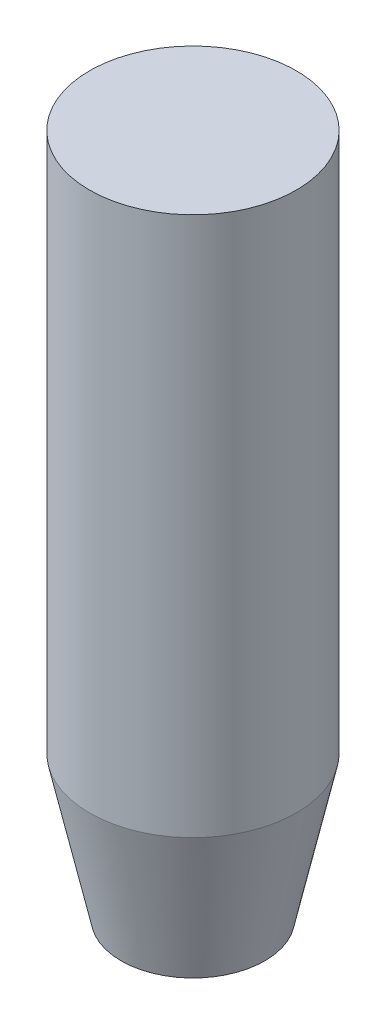
ISO-10303-21;
HEADER;
FILE_DESCRIPTION(('STEP AP214'),'2;1');
FILE_NAME('part.step','',(''),(''),'','','');
FILE_SCHEMA(('AUTOMOTIVE_DESIGN { 1 0 10303 214 1 1 1 1 }'));
ENDSEC;
DATA;
#1=APPLICATION_CONTEXT('core data for automotive mechanical design processes');
#2=APPLICATION_PROTOCOL_DEFINITION('international standard','automotive_design',2000,#1);
#3=PRODUCT_CONTEXT('',#1,'mechanical');
#4=PRODUCT('Part','Part','',(#3));
#5=PRODUCT_RELATED_PRODUCT_CATEGORY('part','',(#4));
#6=PRODUCT_DEFINITION_FORMATION('','',#4);
#7=PRODUCT_DEFINITION_CONTEXT('part definition',#1,'design');
#8=PRODUCT_DEFINITION('design','',#6,#7);
#9=PRODUCT_DEFINITION_SHAPE('','',#8);
#10=(LENGTH_UNIT() NAMED_UNIT(*) SI_UNIT(.MILLI.,.METRE.));
#11=(NAMED_UNIT(*) PLANE_ANGLE_UNIT() SI_UNIT($,.RADIAN.));
#12=(NAMED_UNIT(*) SI_UNIT($,.STERADIAN.) SOLID_ANGLE_UNIT());
#13=UNCERTAINTY_MEASURE_WITH_UNIT(LENGTH_MEASURE(1.E-05),#10,'distance_accuracy_value','');
#14=(GEOMETRIC_REPRESENTATION_CONTEXT(3) GLOBAL_UNCERTAINTY_ASSIGNED_CONTEXT((#13)) GLOBAL_UNIT_ASSIGNED_CONTEXT((#10,
#11,#12)) REPRESENTATION_CONTEXT('',''));
#15=CARTESIAN_POINT('',(0.,0.,0.));
#16=DIRECTION('',(0.,0.,1.));
#17=DIRECTION('',(1.,0.,0.));
#18=AXIS2_PLACEMENT_3D('',#15,#16,#17);
#19=CARTESIAN_POINT('',(0.,120.65,0.));
#20=DIRECTION('',(0.,-1.,0.));
#21=DIRECTION('',(0.,0.,-1.));
#22=AXIS2_PLACEMENT_3D('',#19,#20,#21);
#23=CYLINDRICAL_SURFACE('',#22,18.25625);
#24=CARTESIAN_POINT('',(0.,25.4000000000012,0.));
#25=DIRECTION('',(0.,1.,0.));
#26=DIRECTION('',(0.,0.,1.));
#27=AXIS2_PLACEMENT_3D('',#24,#25,#26);
#28=CIRCLE('',#27,18.25625);
#29=CARTESIAN_POINT('',(0.,25.4000000000012,18.25625));
#30=VERTEX_POINT('',#29);
#31=EDGE_CURVE('E38',#30,#30,#28,.T.);
#32=ORIENTED_EDGE('',*,*,#31,.T.);
#33=EDGE_LOOP('',(#32));
#34=FACE_BOUND('',#33,.T.);
#35=CARTESIAN_POINT('',(0.,120.65,0.));
#36=DIRECTION('',(0.,1.,0.));
#37=DIRECTION('',(0.,0.,1.));
#38=AXIS2_PLACEMENT_3D('',#35,#36,#37);
#39=CIRCLE('',#38,18.25625);
#40=CARTESIAN_POINT('',(0.,120.65,18.25625));
#41=VERTEX_POINT('',#40);
#42=EDGE_CURVE('E42',#41,#41,#39,.T.);
#43=ORIENTED_EDGE('',*,*,#42,.F.);
#44=EDGE_LOOP('',(#43));
#45=FACE_BOUND('',#44,.T.);
#46=ADVANCED_FACE('F31',(#34,#45),#23,.T.);
#47=CARTESIAN_POINT('',(0.,120.65,0.));
#48=DIRECTION('',(0.,1.,0.));
#49=DIRECTION('',(0.,0.,1.));
#50=AXIS2_PLACEMENT_3D('',#47,#48,#49);
#51=PLANE('',#50);
#52=ORIENTED_EDGE('',*,*,#42,.T.);
#53=EDGE_LOOP('',(#52));
#54=FACE_BOUND('',#53,.T.);
#55=ADVANCED_FACE('F49',(#54),#51,.T.);
#56=CARTESIAN_POINT('',(0.,0.,0.));
#57=DIRECTION('',(0.,1.,0.));
#58=DIRECTION('',(0.,0.,1.));
#59=AXIS2_PLACEMENT_3D('',#56,#57,#58);
#60=PLANE('',#59);
#61=CARTESIAN_POINT('',(0.,0.,0.));
#62=DIRECTION('',(0.,1.,0.));
#63=DIRECTION('',(0.,0.,1.));
#64=AXIS2_PLACEMENT_3D('',#61,#62,#63);
#65=CIRCLE('',#64,12.6999999999998);
#66=CARTESIAN_POINT('',(0.,0.,12.6999999999998));
#67=VERTEX_POINT('',#66);
#68=EDGE_CURVE('E10',#67,#67,#65,.F.);
#69=ORIENTED_EDGE('',*,*,#68,.T.);
#70=EDGE_LOOP('',(#69));
#71=FACE_BOUND('',#70,.T.);
#72=ADVANCED_FACE('F55',(#71),#60,.F.);
#73=CARTESIAN_POINT('',(0.,25.4000000000012,0.));
#74=DIRECTION('',(0.,1.,0.));
#75=DIRECTION('',(0.,0.,1.));
#76=AXIS2_PLACEMENT_3D('',#73,#74,#75);
#77=CONICAL_SURFACE('',#76,18.25625,0.215357699697737);
#78=ORIENTED_EDGE('',*,*,#68,.F.);
#79=EDGE_LOOP('',(#78));
#80=FACE_BOUND('',#79,.T.);
#81=ORIENTED_EDGE('',*,*,#31,.F.);
#82=EDGE_LOOP('',(#81));
#83=FACE_BOUND('',#82,.T.);
#84=ADVANCED_FACE('F33',(#80,#83),#77,.T.);
#85=CLOSED_SHELL('',(#46,#55,#72,#84));
#86=MANIFOLD_SOLID_BREP('B2',#85);
#87=ADVANCED_BREP_SHAPE_REPRESENTATION('',(#18,#86),#14);
#88=SHAPE_DEFINITION_REPRESENTATION(#9,#87);
ENDSEC;
END-ISO-10303-21;
